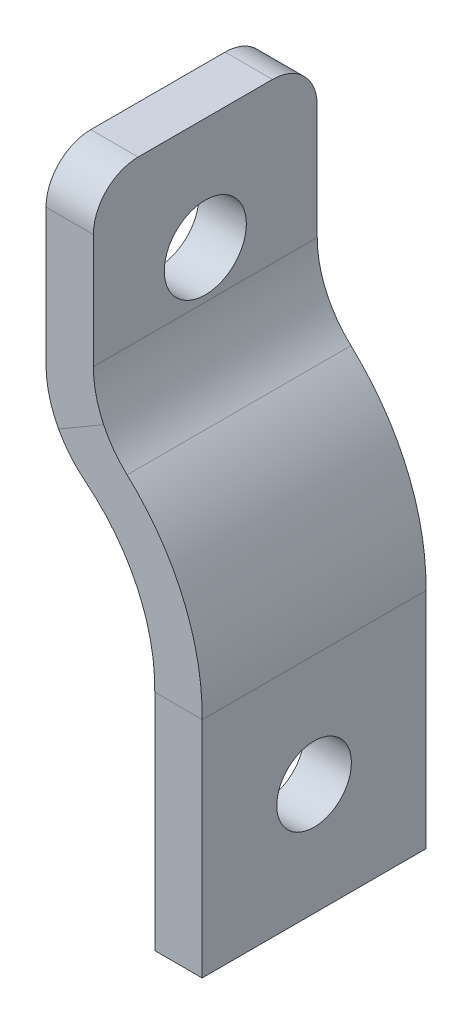
ISO-10303-21;
HEADER;
FILE_DESCRIPTION(('STEP AP214'),'2;1');
FILE_NAME('part.step','',(''),(''),'','','');
FILE_SCHEMA(('AUTOMOTIVE_DESIGN { 1 0 10303 214 1 1 1 1 }'));
ENDSEC;
DATA;
#1=APPLICATION_CONTEXT('core data for automotive mechanical design processes');
#2=APPLICATION_PROTOCOL_DEFINITION('international standard','automotive_design',2000,#1);
#3=PRODUCT_CONTEXT('',#1,'mechanical');
#4=PRODUCT('Part','Part','',(#3));
#5=PRODUCT_RELATED_PRODUCT_CATEGORY('part','',(#4));
#6=PRODUCT_DEFINITION_FORMATION('','',#4);
#7=PRODUCT_DEFINITION_CONTEXT('part definition',#1,'design');
#8=PRODUCT_DEFINITION('design','',#6,#7);
#9=PRODUCT_DEFINITION_SHAPE('','',#8);
#10=(LENGTH_UNIT() NAMED_UNIT(*) SI_UNIT(.MILLI.,.METRE.));
#11=(NAMED_UNIT(*) PLANE_ANGLE_UNIT() SI_UNIT($,.RADIAN.));
#12=(NAMED_UNIT(*) SI_UNIT($,.STERADIAN.) SOLID_ANGLE_UNIT());
#13=UNCERTAINTY_MEASURE_WITH_UNIT(LENGTH_MEASURE(1.E-05),#10,'distance_accuracy_value','');
#14=(GEOMETRIC_REPRESENTATION_CONTEXT(3) GLOBAL_UNCERTAINTY_ASSIGNED_CONTEXT((#13)) GLOBAL_UNIT_ASSIGNED_CONTEXT((#10,
#11,#12)) REPRESENTATION_CONTEXT('',''));
#15=CARTESIAN_POINT('',(0.,0.,0.));
#16=DIRECTION('',(0.,0.,1.));
#17=DIRECTION('',(1.,0.,0.));
#18=AXIS2_PLACEMENT_3D('',#15,#16,#17);
#19=CARTESIAN_POINT('',(0.,7.5,0.));
#20=DIRECTION('',(0.,1.,0.));
#21=DIRECTION('',(0.,0.,1.));
#22=AXIS2_PLACEMENT_3D('',#19,#20,#21);
#23=PLANE('',#22);
#24=DIRECTION('',(0.,0.,1.));
#25=VECTOR('',#24,1.);
#26=CARTESIAN_POINT('',(-15.875,7.5,7.5));
#27=LINE('',#26,#25);
#28=CARTESIAN_POINT('',(-15.875,7.5,-4.5));
#29=VERTEX_POINT('',#28);
#30=CARTESIAN_POINT('',(-15.875,7.5,4.5));
#31=VERTEX_POINT('',#30);
#32=EDGE_CURVE('E277',#29,#31,#27,.T.);
#33=ORIENTED_EDGE('',*,*,#32,.T.);
#34=DIRECTION('',(1.,0.,0.));
#35=VECTOR('',#34,1.);
#36=CARTESIAN_POINT('',(0.,7.5,4.5));
#37=LINE('',#36,#35);
#38=CARTESIAN_POINT('',(-12.7,7.5,4.5));
#39=VERTEX_POINT('',#38);
#40=EDGE_CURVE('E265',#31,#39,#37,.T.);
#41=ORIENTED_EDGE('',*,*,#40,.T.);
#42=DIRECTION('',(0.,0.,-1.));
#43=VECTOR('',#42,1.);
#44=CARTESIAN_POINT('',(-12.7,7.5,7.5));
#45=LINE('',#44,#43);
#46=CARTESIAN_POINT('',(-12.7,7.5,-4.5));
#47=VERTEX_POINT('',#46);
#48=EDGE_CURVE('E286',#39,#47,#45,.T.);
#49=ORIENTED_EDGE('',*,*,#48,.T.);
#50=DIRECTION('',(-1.,0.,0.));
#51=VECTOR('',#50,1.);
#52=CARTESIAN_POINT('',(0.,7.5,-4.50000000000001));
#53=LINE('',#52,#51);
#54=EDGE_CURVE('E262',#47,#29,#53,.T.);
#55=ORIENTED_EDGE('',*,*,#54,.T.);
#56=EDGE_LOOP('',(#33,#41,#49,#55));
#57=FACE_BOUND('',#56,.T.);
#58=ADVANCED_FACE('F40',(#57),#23,.T.);
#59=CARTESIAN_POINT('',(7.28749999999999,-35.,0.));
#60=DIRECTION('',(0.,1.,0.));
#61=DIRECTION('',(0.,0.,1.));
#62=AXIS2_PLACEMENT_3D('',#59,#60,#61);
#63=PLANE('',#62);
#64=DIRECTION('',(0.,0.,1.));
#65=VECTOR('',#64,1.);
#66=CARTESIAN_POINT('',(-8.58750000000001,-35.,7.5));
#67=LINE('',#66,#65);
#68=CARTESIAN_POINT('',(-8.58750000000001,-35.,-7.5));
#69=VERTEX_POINT('',#68);
#70=CARTESIAN_POINT('',(-8.58750000000001,-35.,7.5));
#71=VERTEX_POINT('',#70);
#72=EDGE_CURVE('E169',#69,#71,#67,.T.);
#73=ORIENTED_EDGE('',*,*,#72,.F.);
#74=DIRECTION('',(-1.,0.,0.));
#75=VECTOR('',#74,1.);
#76=CARTESIAN_POINT('',(-5.4125,-35.,-7.50000000000001));
#77=LINE('',#76,#75);
#78=CARTESIAN_POINT('',(-5.4125,-35.,-7.50000000000001));
#79=VERTEX_POINT('',#78);
#80=EDGE_CURVE('E154',#79,#69,#77,.T.);
#81=ORIENTED_EDGE('',*,*,#80,.F.);
#82=DIRECTION('',(0.,0.,-1.));
#83=VECTOR('',#82,1.);
#84=CARTESIAN_POINT('',(-5.4125,-35.,7.5));
#85=LINE('',#84,#83);
#86=CARTESIAN_POINT('',(-5.4125,-35.,7.5));
#87=VERTEX_POINT('',#86);
#88=EDGE_CURVE('E148',#87,#79,#85,.T.);
#89=ORIENTED_EDGE('',*,*,#88,.F.);
#90=DIRECTION('',(1.,0.,0.));
#91=VECTOR('',#90,1.);
#92=CARTESIAN_POINT('',(-5.4125,-35.,7.5));
#93=LINE('',#92,#91);
#94=EDGE_CURVE('E151',#71,#87,#93,.T.);
#95=ORIENTED_EDGE('',*,*,#94,.F.);
#96=EDGE_LOOP('',(#73,#81,#89,#95));
#97=FACE_BOUND('',#96,.T.);
#98=ADVANCED_FACE('F150',(#97),#63,.F.);
#99=CARTESIAN_POINT('',(-12.7,-8.63596447973732,7.5));
#100=DIRECTION('',(1.,0.,0.));
#101=DIRECTION('',(0.,0.,-1.));
#102=AXIS2_PLACEMENT_3D('',#99,#100,#101);
#103=PLANE('',#102);
#104=CARTESIAN_POINT('',(-12.7,0.,0.));
#105=DIRECTION('',(1.,0.,0.));
#106=DIRECTION('',(0.,0.,-1.));
#107=AXIS2_PLACEMENT_3D('',#104,#105,#106);
#108=CIRCLE('',#107,2.74999999999999);
#109=CARTESIAN_POINT('',(-12.7,0.,-2.74999999999999));
#110=VERTEX_POINT('',#109);
#111=EDGE_CURVE('E298',#110,#110,#108,.T.);
#112=ORIENTED_EDGE('',*,*,#111,.F.);
#113=EDGE_LOOP('',(#112));
#114=FACE_BOUND('',#113,.T.);
#115=ORIENTED_EDGE('',*,*,#48,.F.);
#116=CARTESIAN_POINT('',(-12.7,4.5,4.5));
#117=DIRECTION('',(1.,0.,0.));
#118=DIRECTION('',(0.,0.,-1.));
#119=AXIS2_PLACEMENT_3D('',#116,#117,#118);
#120=CIRCLE('',#119,3.);
#121=CARTESIAN_POINT('',(-12.7,4.5,7.5));
#122=VERTEX_POINT('',#121);
#123=EDGE_CURVE('E271',#39,#122,#120,.T.);
#124=ORIENTED_EDGE('',*,*,#123,.T.);
#125=DIRECTION('',(0.,1.,0.));
#126=VECTOR('',#125,1.);
#127=CARTESIAN_POINT('',(-12.7,-8.63596447973732,7.5));
#128=LINE('',#127,#126);
#129=CARTESIAN_POINT('',(-12.7,-3.16883910186593,7.5));
#130=VERTEX_POINT('',#129);
#131=EDGE_CURVE('E293',#130,#122,#128,.T.);
#132=ORIENTED_EDGE('',*,*,#131,.F.);
#133=DIRECTION('',(0.,0.,-1.));
#134=VECTOR('',#133,1.);
#135=CARTESIAN_POINT('',(-12.7,-3.16883910186593,-7.50000000000001));
#136=LINE('',#135,#134);
#137=CARTESIAN_POINT('',(-12.7,-3.16883910186593,-7.50000000000001));
#138=VERTEX_POINT('',#137);
#139=EDGE_CURVE('E193',#130,#138,#136,.T.);
#140=ORIENTED_EDGE('',*,*,#139,.T.);
#141=DIRECTION('',(0.,1.,0.));
#142=VECTOR('',#141,1.);
#143=CARTESIAN_POINT('',(-12.7,-8.63596447973732,-7.50000000000001));
#144=LINE('',#143,#142);
#145=CARTESIAN_POINT('',(-12.7,4.5,-7.50000000000001));
#146=VERTEX_POINT('',#145);
#147=EDGE_CURVE('E297',#138,#146,#144,.T.);
#148=ORIENTED_EDGE('',*,*,#147,.T.);
#149=CARTESIAN_POINT('',(-12.7,4.5,-4.5));
#150=DIRECTION('',(1.,0.,0.));
#151=DIRECTION('',(0.,0.,-1.));
#152=AXIS2_PLACEMENT_3D('',#149,#150,#151);
#153=CIRCLE('',#152,3.);
#154=EDGE_CURVE('E269',#146,#47,#153,.T.);
#155=ORIENTED_EDGE('',*,*,#154,.T.);
#156=EDGE_LOOP('',(#115,#124,#132,#140,#148,#155));
#157=FACE_BOUND('',#156,.T.);
#158=ADVANCED_FACE('F291',(#114,#157),#103,.T.);
#159=CARTESIAN_POINT('',(-12.7,-8.63596447973732,-7.50000000000001));
#160=DIRECTION('',(0.,0.,-1.));
#161=DIRECTION('',(-1.,0.,0.));
#162=AXIS2_PLACEMENT_3D('',#159,#160,#161);
#163=PLANE('',#162);
#164=DIRECTION('',(0.,1.,0.));
#165=VECTOR('',#164,1.);
#166=CARTESIAN_POINT('',(-15.875,-8.63596447973732,-7.5));
#167=LINE('',#166,#165);
#168=CARTESIAN_POINT('',(-15.875,-4.625327713957,-7.5));
#169=VERTEX_POINT('',#168);
#170=CARTESIAN_POINT('',(-15.875,4.5,-7.5));
#171=VERTEX_POINT('',#170);
#172=EDGE_CURVE('E301',#169,#171,#167,.T.);
#173=ORIENTED_EDGE('',*,*,#172,.T.);
#174=DIRECTION('',(-1.,0.,0.));
#175=VECTOR('',#174,1.);
#176=CARTESIAN_POINT('',(-12.7,4.5,-7.50000000000001));
#177=LINE('',#176,#175);
#178=EDGE_CURVE('E11',#171,#146,#177,.F.);
#179=ORIENTED_EDGE('',*,*,#178,.T.);
#180=ORIENTED_EDGE('',*,*,#147,.F.);
#181=CARTESIAN_POINT('',(-5.7,-3.16883910186593,-7.50000000000001));
#182=DIRECTION('',(0.,0.,-1.));
#183=DIRECTION('',(-1.,0.,0.));
#184=AXIS2_PLACEMENT_3D('',#181,#182,#183);
#185=CIRCLE('',#184,7.);
#186=CARTESIAN_POINT('',(-12.0135985680038,-6.19182985972482,-7.5));
#187=VERTEX_POINT('',#186);
#188=EDGE_CURVE('E329',#138,#187,#185,.F.);
#189=ORIENTED_EDGE('',*,*,#188,.T.);
#190=DIRECTION('',(0.86402504386111,0.503448829158245,0.));
#191=VECTOR('',#190,1.);
#192=CARTESIAN_POINT('',(-15.8750001084359,-8.44178557368542,-7.5));
#193=LINE('',#192,#191);
#194=CARTESIAN_POINT('',(-15.0340997008918,-7.95181097326771,-7.5));
#195=VERTEX_POINT('',#194);
#196=EDGE_CURVE('E159',#195,#187,#193,.T.);
#197=ORIENTED_EDGE('',*,*,#196,.F.);
#198=CARTESIAN_POINT('',(-8.875,-4.625327713957,-7.50000000000001));
#199=DIRECTION('',(0.,0.,-1.));
#200=DIRECTION('',(-1.,0.,0.));
#201=AXIS2_PLACEMENT_3D('',#198,#199,#200);
#202=CIRCLE('',#201,7.);
#203=EDGE_CURVE('E319',#195,#169,#202,.T.);
#204=ORIENTED_EDGE('',*,*,#203,.T.);
#205=EDGE_LOOP('',(#173,#179,#180,#189,#197,#204));
#206=FACE_BOUND('',#205,.T.);
#207=ADVANCED_FACE('F350',(#206),#163,.T.);
#208=CARTESIAN_POINT('',(-12.7,-8.63596447973732,7.5));
#209=DIRECTION('',(0.,0.,1.));
#210=DIRECTION('',(1.,0.,0.));
#211=AXIS2_PLACEMENT_3D('',#208,#209,#210);
#212=PLANE('',#211);
#213=ORIENTED_EDGE('',*,*,#131,.T.);
#214=DIRECTION('',(1.,0.,0.));
#215=VECTOR('',#214,1.);
#216=CARTESIAN_POINT('',(-12.7,4.5,7.5));
#217=LINE('',#216,#215);
#218=CARTESIAN_POINT('',(-15.875,4.5,7.5));
#219=VERTEX_POINT('',#218);
#220=EDGE_CURVE('E63',#122,#219,#217,.F.);
#221=ORIENTED_EDGE('',*,*,#220,.T.);
#222=DIRECTION('',(0.,1.,0.));
#223=VECTOR('',#222,1.);
#224=CARTESIAN_POINT('',(-15.875,-8.63596447973732,7.5));
#225=LINE('',#224,#223);
#226=CARTESIAN_POINT('',(-15.875,-4.625327713957,7.5));
#227=VERTEX_POINT('',#226);
#228=EDGE_CURVE('E278',#227,#219,#225,.T.);
#229=ORIENTED_EDGE('',*,*,#228,.F.);
#230=CARTESIAN_POINT('',(-8.875,-4.625327713957,7.5));
#231=DIRECTION('',(0.,0.,1.));
#232=DIRECTION('',(1.,0.,0.));
#233=AXIS2_PLACEMENT_3D('',#230,#231,#232);
#234=CIRCLE('',#233,7.);
#235=CARTESIAN_POINT('',(-15.0340997008918,-7.95181097326771,7.5));
#236=VERTEX_POINT('',#235);
#237=EDGE_CURVE('E325',#227,#236,#234,.T.);
#238=ORIENTED_EDGE('',*,*,#237,.T.);
#239=DIRECTION('',(-0.86402504386111,-0.503448829158245,0.));
#240=VECTOR('',#239,1.);
#241=CARTESIAN_POINT('',(-12.7,-6.59178122655878,7.5));
#242=LINE('',#241,#240);
#243=CARTESIAN_POINT('',(-12.0135985680038,-6.19182985972482,7.5));
#244=VERTEX_POINT('',#243);
#245=EDGE_CURVE('E255',#244,#236,#242,.T.);
#246=ORIENTED_EDGE('',*,*,#245,.F.);
#247=CARTESIAN_POINT('',(-5.7,-3.16883910186593,7.5));
#248=DIRECTION('',(0.,0.,1.));
#249=DIRECTION('',(1.,0.,0.));
#250=AXIS2_PLACEMENT_3D('',#247,#248,#249);
#251=CIRCLE('',#250,7.);
#252=EDGE_CURVE('E266',#244,#130,#251,.F.);
#253=ORIENTED_EDGE('',*,*,#252,.T.);
#254=EDGE_LOOP('',(#213,#221,#229,#238,#246,#253));
#255=FACE_BOUND('',#254,.T.);
#256=ADVANCED_FACE('F295',(#255),#212,.T.);
#257=CARTESIAN_POINT('',(-15.875,-8.63596447973732,7.5));
#258=DIRECTION('',(-1.,0.,0.));
#259=DIRECTION('',(0.,0.,1.));
#260=AXIS2_PLACEMENT_3D('',#257,#258,#259);
#261=PLANE('',#260);
#262=CARTESIAN_POINT('',(-15.875,0.,0.));
#263=DIRECTION('',(-1.,0.,0.));
#264=DIRECTION('',(0.,0.,1.));
#265=AXIS2_PLACEMENT_3D('',#262,#263,#264);
#266=CIRCLE('',#265,2.74999999999999);
#267=CARTESIAN_POINT('',(-15.875,0.,2.74999999999999));
#268=VERTEX_POINT('',#267);
#269=EDGE_CURVE('E304',#268,#268,#266,.T.);
#270=ORIENTED_EDGE('',*,*,#269,.F.);
#271=EDGE_LOOP('',(#270));
#272=FACE_BOUND('',#271,.T.);
#273=ORIENTED_EDGE('',*,*,#228,.T.);
#274=CARTESIAN_POINT('',(-15.875,4.5,4.5));
#275=DIRECTION('',(-1.,0.,0.));
#276=DIRECTION('',(0.,0.,1.));
#277=AXIS2_PLACEMENT_3D('',#274,#275,#276);
#278=CIRCLE('',#277,3.);
#279=EDGE_CURVE('E48',#219,#31,#278,.T.);
#280=ORIENTED_EDGE('',*,*,#279,.T.);
#281=ORIENTED_EDGE('',*,*,#32,.F.);
#282=CARTESIAN_POINT('',(-15.875,4.5,-4.5));
#283=DIRECTION('',(-1.,0.,0.));
#284=DIRECTION('',(0.,0.,1.));
#285=AXIS2_PLACEMENT_3D('',#282,#283,#284);
#286=CIRCLE('',#285,3.);
#287=EDGE_CURVE('E55',#29,#171,#286,.T.);
#288=ORIENTED_EDGE('',*,*,#287,.T.);
#289=ORIENTED_EDGE('',*,*,#172,.F.);
#290=DIRECTION('',(0.,0.,1.));
#291=VECTOR('',#290,1.);
#292=CARTESIAN_POINT('',(-15.875,-4.625327713957,7.5));
#293=LINE('',#292,#291);
#294=EDGE_CURVE('E323',#169,#227,#293,.T.);
#295=ORIENTED_EDGE('',*,*,#294,.T.);
#296=EDGE_LOOP('',(#273,#280,#281,#288,#289,#295));
#297=FACE_BOUND('',#296,.T.);
#298=ADVANCED_FACE('F276',(#272,#297),#261,.T.);
#299=CARTESIAN_POINT('',(-20.9983757298086,-19.7867468004784,0.));
#300=DIRECTION('',(0.,0.,1.));
#301=DIRECTION('',(1.,0.,0.));
#302=AXIS2_PLACEMENT_3D('',#299,#300,#301);
#303=CYLINDRICAL_SURFACE('',#302,15.5875);
#304=CARTESIAN_POINT('',(-20.9983757298086,-19.7867468004784,-7.50000000000001));
#305=DIRECTION('',(0.,0.,1.));
#306=DIRECTION('',(0.999883980700613,-0.0152323713944,0.));
#307=AXIS2_PLACEMENT_3D('',#304,#305,#306);
#308=CIRCLE('',#307,15.5875);
#309=CARTESIAN_POINT('',(-5.41250000000001,-20.0117667661794,-7.50000000000001));
#310=VERTEX_POINT('',#309);
#311=CARTESIAN_POINT('',(-10.4410572267254,-8.31882709922231,-7.50000000000001));
#312=VERTEX_POINT('',#311);
#313=EDGE_CURVE('E194',#310,#312,#308,.T.);
#314=ORIENTED_EDGE('',*,*,#313,.T.);
#315=DIRECTION('',(0.,0.,1.));
#316=VECTOR('',#315,1.);
#317=CARTESIAN_POINT('',(-10.4410572267254,-8.31882709922231,0.));
#318=LINE('',#317,#316);
#319=CARTESIAN_POINT('',(-10.4410572267254,-8.31882709922231,7.5));
#320=VERTEX_POINT('',#319);
#321=EDGE_CURVE('E311',#312,#320,#318,.T.);
#322=ORIENTED_EDGE('',*,*,#321,.T.);
#323=CARTESIAN_POINT('',(-20.9983757298086,-19.7867468004784,7.5));
#324=DIRECTION('',(0.,0.,1.));
#325=DIRECTION('',(0.999883980700613,-0.0152323713944,0.));
#326=AXIS2_PLACEMENT_3D('',#323,#324,#325);
#327=CIRCLE('',#326,15.5875);
#328=CARTESIAN_POINT('',(-5.41250000000001,-20.0117667661794,7.5));
#329=VERTEX_POINT('',#328);
#330=EDGE_CURVE('E198',#329,#320,#327,.T.);
#331=ORIENTED_EDGE('',*,*,#330,.F.);
#332=DIRECTION('',(0.,0.,1.));
#333=VECTOR('',#332,1.);
#334=CARTESIAN_POINT('',(-5.41250000000001,-20.0117667661794,0.));
#335=LINE('',#334,#333);
#336=EDGE_CURVE('E173',#329,#310,#335,.F.);
#337=ORIENTED_EDGE('',*,*,#336,.T.);
#338=EDGE_LOOP('',(#314,#322,#331,#337));
#339=FACE_BOUND('',#338,.T.);
#340=ADVANCED_FACE('F221',(#339),#303,.T.);
#341=CARTESIAN_POINT('',(-8.59036229364111,-20.1757954065515,-7.5));
#342=CARTESIAN_POINT('',(-8.58939004397634,-20.1119749520755,-7.5));
#343=CARTESIAN_POINT('',(-8.58827268052776,-20.0386982245083,-7.5));
#344=CARTESIAN_POINT('',(-8.58276606769066,-19.6768341394664,-7.5));
#345=CARTESIAN_POINT('',(-8.58830167751701,-19.4137376399685,-7.5));
#346=CARTESIAN_POINT('',(-8.61788392858124,-18.8526715481281,-7.5));
#347=CARTESIAN_POINT('',(-8.64220003351567,-18.5726729782134,-7.5));
#348=CARTESIAN_POINT('',(-8.74355113545508,-17.7361328080536,-7.5));
#349=CARTESIAN_POINT('',(-8.84903652110424,-17.1830462968838,-7.5));
#350=CARTESIAN_POINT('',(-9.27630314780402,-15.5529135828288,-7.5));
#351=CARTESIAN_POINT('',(-9.70933107906704,-14.5056699926504,-7.5));
#352=CARTESIAN_POINT('',(-10.8409984311133,-12.5645596117847,-7.5));
#353=CARTESIAN_POINT('',(-11.5389961946689,-11.6717934338356,-7.5));
#354=CARTESIAN_POINT('',(-12.7470748820603,-10.4968741511599,-7.5));
#355=CARTESIAN_POINT('',(-13.1764140352401,-10.1325943864644,-7.5));
#356=CARTESIAN_POINT('',(-13.8544574113397,-9.63226581213585,-7.5));
#357=CARTESIAN_POINT('',(-14.08613854625,-9.47316105469909,-7.5));
#358=CARTESIAN_POINT('',(-14.5598162119036,-9.17100258956319,-7.5));
#359=CARTESIAN_POINT('',(-14.786041221195,-9.03656800995533,-7.5));
#360=CARTESIAN_POINT('',(-15.3619381229485,-8.72200738664864,-7.5));
#361=CARTESIAN_POINT('',(-15.7272498350888,-8.52248528261496,-7.5));
#362=CARTESIAN_POINT('',(-16.0454159398529,-8.34870672062612,-7.5));
#363=CARTESIAN_POINT('',(-8.59036229364111,-20.1757954065515,7.5));
#364=CARTESIAN_POINT('',(-8.58939004397634,-20.1119749520755,7.5));
#365=CARTESIAN_POINT('',(-8.58827268052776,-20.0386982245083,7.5));
#366=CARTESIAN_POINT('',(-8.58276606769066,-19.6768341394664,7.5));
#367=CARTESIAN_POINT('',(-8.58830167751701,-19.4137376399685,7.5));
#368=CARTESIAN_POINT('',(-8.61788392858124,-18.8526715481281,7.5));
#369=CARTESIAN_POINT('',(-8.64220003351567,-18.5726729782134,7.5));
#370=CARTESIAN_POINT('',(-8.74355113545508,-17.7361328080536,7.5));
#371=CARTESIAN_POINT('',(-8.84903652110424,-17.1830462968838,7.5));
#372=CARTESIAN_POINT('',(-9.27630314780402,-15.5529135828288,7.5));
#373=CARTESIAN_POINT('',(-9.70933107906704,-14.5056699926504,7.5));
#374=CARTESIAN_POINT('',(-10.8409984311133,-12.5645596117847,7.5));
#375=CARTESIAN_POINT('',(-11.5389961946689,-11.6717934338356,7.5));
#376=CARTESIAN_POINT('',(-12.7470748820603,-10.4968741511599,7.5));
#377=CARTESIAN_POINT('',(-13.1764140352401,-10.1325943864644,7.5));
#378=CARTESIAN_POINT('',(-13.8544574113397,-9.63226581213585,7.5));
#379=CARTESIAN_POINT('',(-14.08613854625,-9.47316105469909,7.5));
#380=CARTESIAN_POINT('',(-14.5598162119036,-9.17100258956319,7.5));
#381=CARTESIAN_POINT('',(-14.786041221195,-9.03656800995533,7.5));
#382=CARTESIAN_POINT('',(-15.3619381229485,-8.72200738664864,7.5));
#383=CARTESIAN_POINT('',(-15.7272498350888,-8.52248528261496,7.5));
#384=CARTESIAN_POINT('',(-16.0454159398529,-8.34870672062612,7.5));
#385=B_SPLINE_SURFACE_WITH_KNOTS('',1,3,((#341,#342,#343,#344,#345,#346,#347,#348,#349,#350,
#351,#352,#353,#354,#355,#356,#357,#358,#359,#360,#361,#362),(#363,#364,#365,#366,#367,#368,
#369,#370,#371,#372,#373,#374,#375,#376,#377,#378,#379,#380,#381,#382,#383,#384)),.UNSPECIFIED.,
.F.,.F.,.F.,(2,2),(4,2,2,2,2,2,2,2,2,2,4),(0.,1.),(-0.0131444147203949,0.,0.0625,0.125,0.25,0.5,
0.75,0.875,0.9375,1.,1.07465794114652),.UNSPECIFIED.);
#386=CARTESIAN_POINT('',(-20.9983757298086,-19.7867468004784,7.5));
#387=DIRECTION('',(0.,0.,1.));
#388=DIRECTION('',(0.999883980700613,-0.0152323713943998,0.));
#389=AXIS2_PLACEMENT_3D('',#386,#387,#388);
#390=CIRCLE('',#389,12.4125);
#391=CARTESIAN_POINT('',(-8.58731581936223,-19.9758186104114,7.5));
#392=VERTEX_POINT('',#391);
#393=CARTESIAN_POINT('',(-13.2466523854834,-10.0923564893368,7.5));
#394=VERTEX_POINT('',#393);
#395=EDGE_CURVE('E252',#392,#394,#390,.T.);
#396=DIRECTION('',(0.,0.,1.));
#397=VECTOR('',#396,1.);
#398=CARTESIAN_POINT('',(-13.2466636148676,-10.0923705378649,7.5));
#399=LINE('',#398,#397);
#400=CARTESIAN_POINT('',(-13.2466564763725,-10.0923616061491,-7.5));
#401=VERTEX_POINT('',#400);
#402=EDGE_CURVE('E313',#394,#401,#399,.F.);
#403=CARTESIAN_POINT('',(-20.9983757298086,-19.7867468004784,-7.5));
#404=DIRECTION('',(0.,0.,1.));
#405=DIRECTION('',(0.999883980700613,-0.0152323713943998,0.));
#406=AXIS2_PLACEMENT_3D('',#403,#404,#405);
#407=CIRCLE('',#406,12.4125);
#408=CARTESIAN_POINT('',(-8.58731581936223,-19.9758186104114,-7.5));
#409=VERTEX_POINT('',#408);
#410=EDGE_CURVE('E197',#409,#401,#407,.T.);
#411=DIRECTION('',(0.0152323713944003,0.999883980700613,0.));
#412=VECTOR('',#411,1.);
#413=CARTESIAN_POINT('',(-8.59036229364111,-20.1757954065515,-7.5));
#414=LINE('',#413,#412);
#415=CARTESIAN_POINT('',(-8.58750004408827,-19.9879201813065,-7.5));
#416=VERTEX_POINT('',#415);
#417=EDGE_CURVE('E285',#416,#409,#414,.T.);
#418=DIRECTION('',(0.,0.,1.));
#419=VECTOR('',#418,1.);
#420=CARTESIAN_POINT('',(-8.58750000000001,-19.9879201826498,0.));
#421=LINE('',#420,#419);
#422=CARTESIAN_POINT('',(-8.58750004408827,-19.9879201813065,7.5));
#423=VERTEX_POINT('',#422);
#424=EDGE_CURVE('E183',#423,#416,#421,.F.);
#425=DIRECTION('',(0.0152323713944003,0.999883980700613,0.));
#426=VECTOR('',#425,1.);
#427=CARTESIAN_POINT('',(-8.59036229364111,-20.1757954065515,7.5));
#428=LINE('',#427,#426);
#429=EDGE_CURVE('E201',#423,#392,#428,.T.);
#430=ORIENTED_EDGE('',*,*,#395,.T.);
#431=ORIENTED_EDGE('',*,*,#402,.T.);
#432=ORIENTED_EDGE('',*,*,#410,.F.);
#433=ORIENTED_EDGE('',*,*,#417,.F.);
#434=ORIENTED_EDGE('',*,*,#424,.F.);
#435=ORIENTED_EDGE('',*,*,#429,.T.);
#436=EDGE_LOOP('',(#430,#431,#432,#433,#434,#435));
#437=FACE_BOUND('',#436,.T.);
#438=ADVANCED_FACE('F208',(#437),#385,.T.);
#439=CARTESIAN_POINT('',(-5.41573065491666,-20.2241581857287,7.5));
#440=DIRECTION('',(0.,0.,1.));
#441=DIRECTION('',(1.,0.,0.));
#442=AXIS2_PLACEMENT_3D('',#439,#440,#441);
#443=PLANE('',#442);
#444=ORIENTED_EDGE('',*,*,#245,.T.);
#445=CARTESIAN_POINT('',(-8.875,-4.625327713957,7.5));
#446=DIRECTION('',(0.,0.,1.));
#447=DIRECTION('',(1.,0.,0.));
#448=AXIS2_PLACEMENT_3D('',#445,#446,#447);
#449=CIRCLE('',#448,7.);
#450=EDGE_CURVE('E327',#236,#394,#449,.T.);
#451=ORIENTED_EDGE('',*,*,#450,.T.);
#452=ORIENTED_EDGE('',*,*,#395,.F.);
#453=ORIENTED_EDGE('',*,*,#429,.F.);
#454=DIRECTION('',(0.999971795620203,-0.00751052355741597,0.));
#455=VECTOR('',#454,1.);
#456=CARTESIAN_POINT('',(-8.58750000000001,-19.9879201813065,7.5));
#457=LINE('',#456,#455);
#458=EDGE_CURVE('E188',#423,#329,#457,.T.);
#459=ORIENTED_EDGE('',*,*,#458,.T.);
#460=ORIENTED_EDGE('',*,*,#330,.T.);
#461=CARTESIAN_POINT('',(-5.7,-3.16883910186593,7.5));
#462=DIRECTION('',(0.,0.,1.));
#463=DIRECTION('',(1.,0.,0.));
#464=AXIS2_PLACEMENT_3D('',#461,#462,#463);
#465=CIRCLE('',#464,7.);
#466=EDGE_CURVE('E336',#320,#244,#465,.F.);
#467=ORIENTED_EDGE('',*,*,#466,.T.);
#468=EDGE_LOOP('',(#444,#451,#452,#453,#459,#460,#467));
#469=FACE_BOUND('',#468,.T.);
#470=ADVANCED_FACE('F220',(#469),#443,.T.);
#471=CARTESIAN_POINT('',(-5.41573065491666,-20.2241581857287,-7.50000000000001));
#472=DIRECTION('',(0.,0.,-1.));
#473=DIRECTION('',(-1.,0.,0.));
#474=AXIS2_PLACEMENT_3D('',#471,#472,#473);
#475=PLANE('',#474);
#476=ORIENTED_EDGE('',*,*,#410,.T.);
#477=CARTESIAN_POINT('',(-8.875,-4.625327713957,-7.5));
#478=DIRECTION('',(0.,0.,-1.));
#479=DIRECTION('',(-1.,0.,0.));
#480=AXIS2_PLACEMENT_3D('',#477,#478,#479);
#481=CIRCLE('',#480,7.);
#482=EDGE_CURVE('E315',#401,#195,#481,.T.);
#483=ORIENTED_EDGE('',*,*,#482,.T.);
#484=ORIENTED_EDGE('',*,*,#196,.T.);
#485=CARTESIAN_POINT('',(-5.7,-3.16883910186593,-7.50000000000001));
#486=DIRECTION('',(0.,0.,-1.));
#487=DIRECTION('',(-1.,0.,0.));
#488=AXIS2_PLACEMENT_3D('',#485,#486,#487);
#489=CIRCLE('',#488,7.);
#490=EDGE_CURVE('E334',#187,#312,#489,.F.);
#491=ORIENTED_EDGE('',*,*,#490,.T.);
#492=ORIENTED_EDGE('',*,*,#313,.F.);
#493=DIRECTION('',(0.999971795620203,-0.00751052355741597,0.));
#494=VECTOR('',#493,1.);
#495=CARTESIAN_POINT('',(-8.58750000000001,-19.9879201813065,-7.5));
#496=LINE('',#495,#494);
#497=EDGE_CURVE('E190',#416,#310,#496,.T.);
#498=ORIENTED_EDGE('',*,*,#497,.F.);
#499=ORIENTED_EDGE('',*,*,#417,.T.);
#500=EDGE_LOOP('',(#476,#483,#484,#491,#492,#498,#499));
#501=FACE_BOUND('',#500,.T.);
#502=ADVANCED_FACE('F223',(#501),#475,.T.);
#503=CARTESIAN_POINT('',(-5.4125,-35.,7.5));
#504=DIRECTION('',(1.,0.,0.));
#505=DIRECTION('',(0.,1.,0.));
#506=AXIS2_PLACEMENT_3D('',#503,#504,#505);
#507=PLANE('',#506);
#508=CARTESIAN_POINT('',(-5.4125,-27.5,0.));
#509=DIRECTION('',(1.,0.,0.));
#510=DIRECTION('',(0.,1.,0.));
#511=AXIS2_PLACEMENT_3D('',#508,#509,#510);
#512=CIRCLE('',#511,2.5);
#513=CARTESIAN_POINT('',(-5.4125,-25.,0.));
#514=VERTEX_POINT('',#513);
#515=EDGE_CURVE('E261',#514,#514,#512,.T.);
#516=ORIENTED_EDGE('',*,*,#515,.F.);
#517=EDGE_LOOP('',(#516));
#518=FACE_BOUND('',#517,.T.);
#519=ORIENTED_EDGE('',*,*,#336,.F.);
#520=DIRECTION('',(0.,1.,0.));
#521=VECTOR('',#520,1.);
#522=CARTESIAN_POINT('',(-5.4125,-35.,7.5));
#523=LINE('',#522,#521);
#524=EDGE_CURVE('E166',#87,#329,#523,.T.);
#525=ORIENTED_EDGE('',*,*,#524,.F.);
#526=ORIENTED_EDGE('',*,*,#88,.T.);
#527=DIRECTION('',(0.,1.,0.));
#528=VECTOR('',#527,1.);
#529=CARTESIAN_POINT('',(-5.4125,-35.,-7.50000000000001));
#530=LINE('',#529,#528);
#531=EDGE_CURVE('E174',#79,#310,#530,.T.);
#532=ORIENTED_EDGE('',*,*,#531,.T.);
#533=EDGE_LOOP('',(#519,#525,#526,#532));
#534=FACE_BOUND('',#533,.T.);
#535=ADVANCED_FACE('F172',(#518,#534),#507,.T.);
#536=CARTESIAN_POINT('',(-5.4125,-35.,7.5));
#537=DIRECTION('',(0.,0.,1.));
#538=DIRECTION('',(1.,0.,0.));
#539=AXIS2_PLACEMENT_3D('',#536,#537,#538);
#540=PLANE('',#539);
#541=ORIENTED_EDGE('',*,*,#458,.F.);
#542=DIRECTION('',(0.,1.,0.));
#543=VECTOR('',#542,1.);
#544=CARTESIAN_POINT('',(-8.58750000000001,-35.,7.5));
#545=LINE('',#544,#543);
#546=EDGE_CURVE('E168',#71,#423,#545,.T.);
#547=ORIENTED_EDGE('',*,*,#546,.F.);
#548=ORIENTED_EDGE('',*,*,#94,.T.);
#549=ORIENTED_EDGE('',*,*,#524,.T.);
#550=EDGE_LOOP('',(#541,#547,#548,#549));
#551=FACE_BOUND('',#550,.T.);
#552=ADVANCED_FACE('F165',(#551),#540,.T.);
#553=CARTESIAN_POINT('',(-8.58750000000001,-35.,7.5));
#554=DIRECTION('',(-1.,0.,0.));
#555=DIRECTION('',(0.,-1.,0.));
#556=AXIS2_PLACEMENT_3D('',#553,#554,#555);
#557=PLANE('',#556);
#558=CARTESIAN_POINT('',(-8.58750000000001,-27.5,0.));
#559=DIRECTION('',(-1.,0.,0.));
#560=DIRECTION('',(0.,-1.,0.));
#561=AXIS2_PLACEMENT_3D('',#558,#559,#560);
#562=CIRCLE('',#561,2.5);
#563=CARTESIAN_POINT('',(-8.58750000000001,-30.,0.));
#564=VERTEX_POINT('',#563);
#565=EDGE_CURVE('E258',#564,#564,#562,.T.);
#566=ORIENTED_EDGE('',*,*,#565,.F.);
#567=EDGE_LOOP('',(#566));
#568=FACE_BOUND('',#567,.T.);
#569=ORIENTED_EDGE('',*,*,#546,.T.);
#570=ORIENTED_EDGE('',*,*,#424,.T.);
#571=DIRECTION('',(0.,1.,0.));
#572=VECTOR('',#571,1.);
#573=CARTESIAN_POINT('',(-8.58750000000001,-35.,-7.5));
#574=LINE('',#573,#572);
#575=EDGE_CURVE('E176',#69,#416,#574,.T.);
#576=ORIENTED_EDGE('',*,*,#575,.F.);
#577=ORIENTED_EDGE('',*,*,#72,.T.);
#578=EDGE_LOOP('',(#569,#570,#576,#577));
#579=FACE_BOUND('',#578,.T.);
#580=ADVANCED_FACE('F384',(#568,#579),#557,.T.);
#581=CARTESIAN_POINT('',(-5.4125,-35.,-7.50000000000001));
#582=DIRECTION('',(0.,0.,-1.));
#583=DIRECTION('',(-1.,0.,0.));
#584=AXIS2_PLACEMENT_3D('',#581,#582,#583);
#585=PLANE('',#584);
#586=ORIENTED_EDGE('',*,*,#575,.T.);
#587=ORIENTED_EDGE('',*,*,#497,.T.);
#588=ORIENTED_EDGE('',*,*,#531,.F.);
#589=ORIENTED_EDGE('',*,*,#80,.T.);
#590=EDGE_LOOP('',(#586,#587,#588,#589));
#591=FACE_BOUND('',#590,.T.);
#592=ADVANCED_FACE('F386',(#591),#585,.T.);
#593=CARTESIAN_POINT('',(-5.7,-3.16883910186593,0.));
#594=DIRECTION('',(0.,0.,1.));
#595=DIRECTION('',(1.,0.,0.));
#596=AXIS2_PLACEMENT_3D('',#593,#594,#595);
#597=CYLINDRICAL_SURFACE('',#596,7.);
#598=ORIENTED_EDGE('',*,*,#466,.F.);
#599=ORIENTED_EDGE('',*,*,#321,.F.);
#600=ORIENTED_EDGE('',*,*,#490,.F.);
#601=ORIENTED_EDGE('',*,*,#188,.F.);
#602=ORIENTED_EDGE('',*,*,#139,.F.);
#603=ORIENTED_EDGE('',*,*,#252,.F.);
#604=EDGE_LOOP('',(#598,#599,#600,#601,#602,#603));
#605=FACE_BOUND('',#604,.T.);
#606=ADVANCED_FACE('F345',(#605),#597,.F.);
#607=CARTESIAN_POINT('',(-8.875,-4.625327713957,0.));
#608=DIRECTION('',(0.,0.,1.));
#609=DIRECTION('',(1.,0.,0.));
#610=AXIS2_PLACEMENT_3D('',#607,#608,#609);
#611=CYLINDRICAL_SURFACE('',#610,7.);
#612=ORIENTED_EDGE('',*,*,#237,.F.);
#613=ORIENTED_EDGE('',*,*,#294,.F.);
#614=ORIENTED_EDGE('',*,*,#203,.F.);
#615=ORIENTED_EDGE('',*,*,#482,.F.);
#616=ORIENTED_EDGE('',*,*,#402,.F.);
#617=ORIENTED_EDGE('',*,*,#450,.F.);
#618=EDGE_LOOP('',(#612,#613,#614,#615,#616,#617));
#619=FACE_BOUND('',#618,.T.);
#620=ADVANCED_FACE('F393',(#619),#611,.T.);
#621=CARTESIAN_POINT('',(-15.875,0.,0.));
#622=DIRECTION('',(-1.,0.,0.));
#623=DIRECTION('',(0.,0.,1.));
#624=AXIS2_PLACEMENT_3D('',#621,#622,#623);
#625=CYLINDRICAL_SURFACE('',#624,2.74999999999999);
#626=ORIENTED_EDGE('',*,*,#111,.T.);
#627=EDGE_LOOP('',(#626));
#628=FACE_BOUND('',#627,.T.);
#629=ORIENTED_EDGE('',*,*,#269,.T.);
#630=EDGE_LOOP('',(#629));
#631=FACE_BOUND('',#630,.T.);
#632=ADVANCED_FACE('F414',(#628,#631),#625,.F.);
#633=CARTESIAN_POINT('',(-5.41087572980857,-27.5,0.));
#634=DIRECTION('',(-1.,0.,0.));
#635=DIRECTION('',(0.,-1.,0.));
#636=AXIS2_PLACEMENT_3D('',#633,#634,#635);
#637=CYLINDRICAL_SURFACE('',#636,2.5);
#638=ORIENTED_EDGE('',*,*,#515,.T.);
#639=EDGE_LOOP('',(#638));
#640=FACE_BOUND('',#639,.T.);
#641=ORIENTED_EDGE('',*,*,#565,.T.);
#642=EDGE_LOOP('',(#641));
#643=FACE_BOUND('',#642,.T.);
#644=ADVANCED_FACE('F419',(#640,#643),#637,.F.);
#645=CARTESIAN_POINT('',(0.,4.5,4.5));
#646=DIRECTION('',(1.,0.,0.));
#647=DIRECTION('',(0.,0.,-1.));
#648=AXIS2_PLACEMENT_3D('',#645,#646,#647);
#649=CYLINDRICAL_SURFACE('',#648,3.);
#650=ORIENTED_EDGE('',*,*,#279,.F.);
#651=ORIENTED_EDGE('',*,*,#220,.F.);
#652=ORIENTED_EDGE('',*,*,#123,.F.);
#653=ORIENTED_EDGE('',*,*,#40,.F.);
#654=EDGE_LOOP('',(#650,#651,#652,#653));
#655=FACE_BOUND('',#654,.T.);
#656=ADVANCED_FACE('F288',(#655),#649,.T.);
#657=CARTESIAN_POINT('',(0.,4.5,-4.50000000000001));
#658=DIRECTION('',(-1.,0.,0.));
#659=DIRECTION('',(0.,0.,1.));
#660=AXIS2_PLACEMENT_3D('',#657,#658,#659);
#661=CYLINDRICAL_SURFACE('',#660,3.);
#662=ORIENTED_EDGE('',*,*,#154,.F.);
#663=ORIENTED_EDGE('',*,*,#178,.F.);
#664=ORIENTED_EDGE('',*,*,#287,.F.);
#665=ORIENTED_EDGE('',*,*,#54,.F.);
#666=EDGE_LOOP('',(#662,#663,#664,#665));
#667=FACE_BOUND('',#666,.T.);
#668=ADVANCED_FACE('F42',(#667),#661,.T.);
#669=CLOSED_SHELL('',(#58,#98,#158,#207,#256,#298,#340,#438,#470,#502,#535,#552,#580,#592,#606,
#620,#632,#644,#656,#668));
#670=MANIFOLD_SOLID_BREP('B2',#669);
#671=ADVANCED_BREP_SHAPE_REPRESENTATION('',(#18,#670),#14);
#672=SHAPE_DEFINITION_REPRESENTATION(#9,#671);
ENDSEC;
END-ISO-10303-21;
